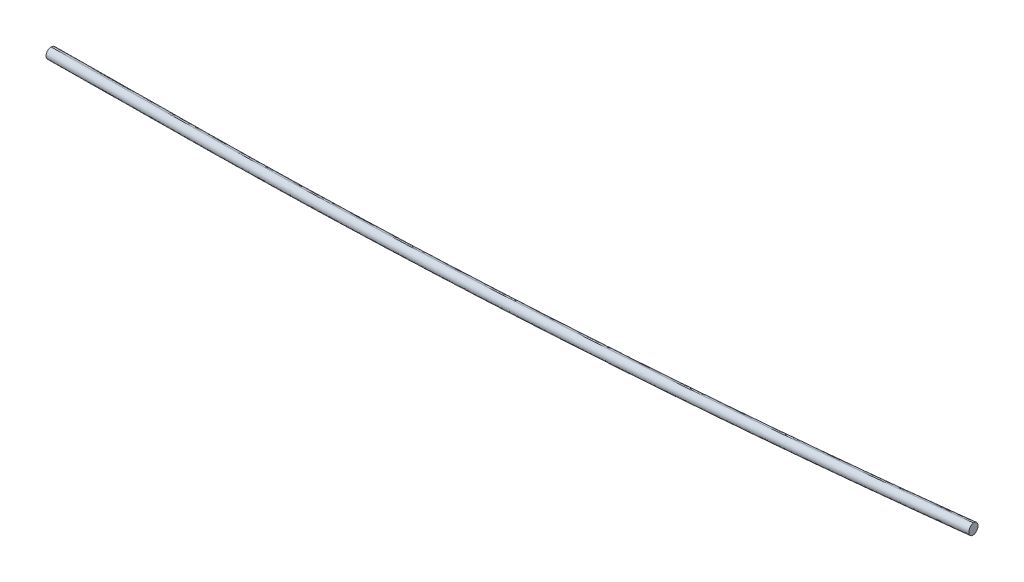
ISO-10303-21;
HEADER;
FILE_DESCRIPTION(('STEP AP214'),'2;1');
FILE_NAME('part.step','',(''),(''),'','','');
FILE_SCHEMA(('AUTOMOTIVE_DESIGN { 1 0 10303 214 1 1 1 1 }'));
ENDSEC;
DATA;
#1=APPLICATION_CONTEXT('core data for automotive mechanical design processes');
#2=APPLICATION_PROTOCOL_DEFINITION('international standard','automotive_design',2000,#1);
#3=PRODUCT_CONTEXT('',#1,'mechanical');
#4=PRODUCT('Part','Part','',(#3));
#5=PRODUCT_RELATED_PRODUCT_CATEGORY('part','',(#4));
#6=PRODUCT_DEFINITION_FORMATION('','',#4);
#7=PRODUCT_DEFINITION_CONTEXT('part definition',#1,'design');
#8=PRODUCT_DEFINITION('design','',#6,#7);
#9=PRODUCT_DEFINITION_SHAPE('','',#8);
#10=(LENGTH_UNIT() NAMED_UNIT(*) SI_UNIT(.MILLI.,.METRE.));
#11=(NAMED_UNIT(*) PLANE_ANGLE_UNIT() SI_UNIT($,.RADIAN.));
#12=(NAMED_UNIT(*) SI_UNIT($,.STERADIAN.) SOLID_ANGLE_UNIT());
#13=UNCERTAINTY_MEASURE_WITH_UNIT(LENGTH_MEASURE(1.E-05),#10,'distance_accuracy_value','');
#14=(GEOMETRIC_REPRESENTATION_CONTEXT(3) GLOBAL_UNCERTAINTY_ASSIGNED_CONTEXT((#13)) GLOBAL_UNIT_ASSIGNED_CONTEXT((#10,
#11,#12)) REPRESENTATION_CONTEXT('',''));
#15=CARTESIAN_POINT('',(0.,0.,0.));
#16=DIRECTION('',(0.,0.,1.));
#17=DIRECTION('',(1.,0.,0.));
#18=AXIS2_PLACEMENT_3D('',#15,#16,#17);
#19=CARTESIAN_POINT('',(48.2480433152623,-0.345679682290023,-13.036057605135));
#20=CARTESIAN_POINT('',(38.1962285899839,-0.437378649195115,-11.90775380431));
#21=CARTESIAN_POINT('',(25.9777641534719,-0.548843155517252,-11.1113298148152));
#22=CARTESIAN_POINT('',(13.3718044772752,-0.663842636779822,-11.0084394877684));
#23=CARTESIAN_POINT('',(10.1395513241844,-0.69332928003925,-11.014852044903));
#24=CARTESIAN_POINT('',(7.86282266951127,-0.714099028712762,-11.0125531852611));
#25=CARTESIAN_POINT('',(5.95615670387059,-0.7314928331213,-11.0142054689053));
#26=CARTESIAN_POINT('',(4.78825930001637,-0.742147126730119,-11.0133602864107));
#27=CARTESIAN_POINT('',(48.2490336071157,-0.328867365471454,-13.02586452825));
#28=CARTESIAN_POINT('',(38.1969245008365,-0.420569017904918,-11.897528610167));
#29=CARTESIAN_POINT('',(25.978026001136,-0.532037484024071,-11.1010734068498));
#30=CARTESIAN_POINT('',(13.3716936881949,-0.647040364712956,-10.998183093019));
#31=CARTESIAN_POINT('',(10.1393932989886,-0.676527438889997,-11.0045947753367));
#32=CARTESIAN_POINT('',(7.86267456311472,-0.697297097077893,-11.0022964543361));
#33=CARTESIAN_POINT('',(5.95600011428303,-0.714690978875526,-11.003948314129));
#34=CARTESIAN_POINT('',(4.78810729009024,-0.725345230705798,-11.0031033565329));
#35=CARTESIAN_POINT('',(48.2523907534692,-0.285489373296981,-12.992416543255));
#36=CARTESIAN_POINT('',(38.1993156531754,-0.377199838134534,-11.863975234271));
#37=CARTESIAN_POINT('',(25.9789928005527,-0.4886812980956,-11.067417604622));
#38=CARTESIAN_POINT('',(13.371437701942,-0.603695333803426,-10.9645273341587));
#39=CARTESIAN_POINT('',(10.1389823101964,-0.633183822010878,-10.9709361458164));
#40=CARTESIAN_POINT('',(7.86229612228021,-0.653953183275962,-10.9686395923355));
#41=CARTESIAN_POINT('',(5.95559383635184,-0.671347319020975,-10.9702900612854));
#42=CARTESIAN_POINT('',(4.78771604004973,-0.682001433757389,-10.9694458416803));
#43=CARTESIAN_POINT('',(48.2605466762364,-0.236173789437014,-12.915715991235));
#44=CARTESIAN_POINT('',(38.2052564268256,-0.327904462256023,-11.7870330072934));
#45=CARTESIAN_POINT('',(25.9816673488715,-0.439415718775895,-10.9902405008317));
#46=CARTESIAN_POINT('',(13.3713082447064,-0.554455334383427,-10.8873503298156));
#47=CARTESIAN_POINT('',(10.1384974121058,-0.583947065145591,-10.8937525586789));
#48=CARTESIAN_POINT('',(7.86188586086493,-0.604715745528048,-10.8914600583491));
#49=CARTESIAN_POINT('',(5.95511974087571,-0.622110463607454,-10.893107337916));
#50=CARTESIAN_POINT('',(4.78727640547068,-0.632764263969922,-10.8922648106197));
#51=CARTESIAN_POINT('',(48.2707128284359,-0.220033257834718,-12.823796329898));
#52=CARTESIAN_POINT('',(38.2127678946473,-0.311788148351879,-11.6948237172693));
#53=CARTESIAN_POINT('',(25.9852644990292,-0.423335113735846,-10.8977497291683));
#54=CARTESIAN_POINT('',(13.3715450117206,-0.53840538486888,-10.794859677332));
#55=CARTESIAN_POINT('',(10.1383082108367,-0.567901001581252,-10.8012540172269));
#56=CARTESIAN_POINT('',(7.86178610586194,-0.588668865978693,-10.7989663742842));
#57=CARTESIAN_POINT('',(5.95494348570192,-0.606064281940703,-10.800609831623));
#58=CARTESIAN_POINT('',(4.78714144900744,-0.616717705550396,-10.7997693324277));
#59=CARTESIAN_POINT('',(48.2811717522907,-0.235985634539793,-12.731876668561));
#60=CARTESIAN_POINT('',(38.2205721341244,-0.327764742755107,-11.6026144272452));
#61=CARTESIAN_POINT('',(25.9891544208522,-0.439347417003077,-10.8052589575049));
#62=CARTESIAN_POINT('',(13.3720745504102,-0.554448343661523,-10.7023690248484));
#63=CARTESIAN_POINT('',(10.1384117812329,-0.583947846324193,-10.7087554757748));
#64=CARTESIAN_POINT('',(7.86197912252329,-0.604714894736628,-10.7064726902193));
#65=CARTESIAN_POINT('',(5.95506000219446,-0.622111008581223,-10.7081123253301));
#66=CARTESIAN_POINT('',(4.78729926421052,-0.632764055438141,-10.7072738542356));
#67=CARTESIAN_POINT('',(48.2916982080869,-0.293137218096374,-12.642704893152));
#68=CARTESIAN_POINT('',(38.2285232658205,-0.384939820035545,-11.5131616814338));
#69=CARTESIAN_POINT('',(25.9933082511752,-0.496557135651513,-10.7155331447876));
#70=CARTESIAN_POINT('',(13.3729684543397,-0.611687801405897,-10.612643327748));
#71=CARTESIAN_POINT('',(10.1388924509553,-0.641191073850534,-10.6190221255422));
#72=CARTESIAN_POINT('',(7.86254656456604,-0.661957330671365,-10.6167440521649));
#73=CARTESIAN_POINT('',(5.95555323099625,-0.679354121535754,-10.6183799793111));
#74=CARTESIAN_POINT('',(4.78783255712124,-0.690006802902709,-10.6175434756886));
#75=CARTESIAN_POINT('',(48.2988677017085,-0.382000701961753,-12.586030928852));
#76=CARTESIAN_POINT('',(38.2340559878887,-0.473818235558998,-11.4563091437403));
#77=CARTESIAN_POINT('',(25.9964275624862,-0.585457567823621,-10.6585070568423));
#78=CARTESIAN_POINT('',(13.3740158886321,-0.700607134541399,-10.5556173132841));
#79=CARTESIAN_POINT('',(10.139677250342,-0.730112802906591,-10.5619912470579));
#80=CARTESIAN_POINT('',(7.863386512921,-0.750878556623899,-10.5597161685501));
#81=CARTESIAN_POINT('',(5.95634601242483,-0.768275777774612,-10.5613497390642));
#82=CARTESIAN_POINT('',(4.78865080167329,-0.778928226850963,-10.5605144858871));
#83=CARTESIAN_POINT('',(48.3015128404969,-0.475111946549727,-12.570026314331));
#84=CARTESIAN_POINT('',(38.2362389056503,-0.566933696817474,-11.4402541004491));
#85=CARTESIAN_POINT('',(25.9979289378569,-0.678579246539826,-10.6424030033059));
#86=CARTESIAN_POINT('',(13.3749321700688,-0.793734150851934,-10.5395132804988));
#87=CARTESIAN_POINT('',(10.1405193642048,-0.823240495820316,-10.5458858406829));
#88=CARTESIAN_POINT('',(7.86424420074179,-0.844006107462198,-10.5436116079202));
#89=CARTESIAN_POINT('',(5.95719038039987,-0.86140345012491,-10.5452445129261));
#90=CARTESIAN_POINT('',(4.78950236038411,-0.872055833602852,-10.5444096128723));
#91=CARTESIAN_POINT('',(48.3005715606973,-0.568255908700491,-12.585988843174));
#92=CARTESIAN_POINT('',(38.2357586314281,-0.660073453385829,-11.4562669254544));
#93=CARTESIAN_POINT('',(25.9981284138401,-0.771712801999894,-10.6584647096792));
#94=CARTESIAN_POINT('',(13.3757152014201,-0.886862382753436,-10.5555749661756));
#95=CARTESIAN_POINT('',(10.1413763681041,-0.916368052897777,-10.5619488963374));
#96=CARTESIAN_POINT('',(7.86508567163637,-0.937133806241483,-10.5596738200535));
#97=CARTESIAN_POINT('',(5.95804513611466,-0.954531027711721,-10.5613073888176));
#98=CARTESIAN_POINT('',(4.79034994427133,-0.965183476615579,-10.5604721365691));
#99=CARTESIAN_POINT('',(48.2950008542725,-0.657235616672097,-12.642873235866));
#100=CARTESIAN_POINT('',(38.2318307738339,-0.749038174258622,-11.5133305545775));
#101=CARTESIAN_POINT('',(25.9966229279103,-0.860655424477008,-10.71570253344));
#102=CARTESIAN_POINT('',(13.3762892853188,-0.975786034088514,-10.6128127161821));
#103=CARTESIAN_POINT('',(10.1422140620578,-1.00528929941637,-10.6191915284243));
#104=CARTESIAN_POINT('',(7.86586801185541,-1.02605555773161,-10.6169134461512));
#105=CARTESIAN_POINT('',(5.95887481838879,-1.04345234731789,-10.6185493802974));
#106=CARTESIAN_POINT('',(4.79115406887992,-1.05410502937483,-10.6177128729606));
#107=CARTESIAN_POINT('',(48.2856085197856,-0.714568911943515,-12.731245383381));
#108=CARTESIAN_POINT('',(38.224990669798,-0.806348186480954,-11.6019811529561));
#109=CARTESIAN_POINT('',(25.9935460738044,-0.917931105969993,-10.8046237500583));
#110=CARTESIAN_POINT('',(13.3764431249426,-1.03303224316428,-10.7017338182202));
#111=CARTESIAN_POINT('',(10.1427774303071,-1.06253177251481,-10.7081202149669));
#112=CARTESIAN_POINT('',(7.86634538589593,-1.08329881532323,-10.7058374627708));
#113=CARTESIAN_POINT('',(5.95942574017996,-1.10069493396074,-10.7074770716314));
#114=CARTESIAN_POINT('',(4.79166528582622,-1.11134797823021,-10.7066386144655));
#115=CARTESIAN_POINT('',(48.2753715432232,-0.730710089650132,-12.823796329898));
#116=CARTESIAN_POINT('',(38.2174266094346,-0.822464980167293,-11.6948237172693));
#117=CARTESIAN_POINT('',(25.9899232138165,-0.93401194555126,-10.8977497291683));
#118=CARTESIAN_POINT('',(13.3762037265079,-1.04908221668429,-10.794859677332));
#119=CARTESIAN_POINT('',(10.142966925624,-1.07857783339667,-10.8012540172269));
#120=CARTESIAN_POINT('',(7.86644482064924,-1.09934569779411,-10.7989663742842));
#121=CARTESIAN_POINT('',(5.95960220048922,-1.11674111375612,-10.800609831623));
#122=CARTESIAN_POINT('',(4.79180016379473,-1.12739453736581,-10.7997693324277));
#123=CARTESIAN_POINT('',(48.2648417949854,-0.714758359049558,-12.916347276414));
#124=CARTESIAN_POINT('',(38.209569777396,-0.806488865546442,-11.7876662815825));
#125=CARTESIAN_POINT('',(25.9860075821733,-0.917999876825155,-10.9908757082784));
#126=CARTESIAN_POINT('',(13.3756715564078,-1.03303928189703,-10.8879855364438));
#127=CARTESIAN_POINT('',(10.1428636492755,-1.06253098597124,-10.8943878194869));
#128=CARTESIAN_POINT('',(7.86625148373622,-1.08329967195771,-10.8920952857975));
#129=CARTESIAN_POINT('',(5.95948588913414,-1.1006943852442,-10.8937425916147));
#130=CARTESIAN_POINT('',(4.79164227009791,-1.11134818819413,-10.8929000503899));
#131=CARTESIAN_POINT('',(48.255864693293,-0.665599073399004,-12.992360033439));
#132=CARTESIAN_POINT('',(38.2027879609671,-0.757309553124979,-11.863918546398));
#133=CARTESIAN_POINT('',(25.9824627019245,-0.868791035038918,-11.0673607437021));
#134=CARTESIAN_POINT('',(13.3749055374297,-0.983805089593036,-10.964470473312));
#135=CARTESIAN_POINT('',(10.142449883812,-1.01329358018945,-10.9708792801198));
#136=CARTESIAN_POINT('',(7.86576375088556,-1.03406294095288,-10.9685827296251));
#137=CARTESIAN_POINT('',(5.95906141792614,-1.05145707712694,-10.9702331962251));
#138=CARTESIAN_POINT('',(4.79118364701398,-1.06211119163173,-10.9693889778669));
#139=CARTESIAN_POINT('',(48.2517168155629,-0.622289546767707,-13.025807246383));
#140=CARTESIAN_POINT('',(38.1996060549526,-0.713991214293019,-11.897471147811));
#141=CARTESIAN_POINT('',(25.9807051159636,-0.825459702664994,-11.1010157690819));
#142=CARTESIAN_POINT('',(13.3743707089196,-0.940462602457601,-10.9981254553254));
#143=CARTESIAN_POINT('',(10.1420700542623,-0.969949679056151,-11.0045371327269));
#144=CARTESIAN_POINT('',(7.86535137412814,-0.990719336735655,-11.0022388147534));
#145=CARTESIAN_POINT('',(5.95867687762343,-1.00811321896809,-11.0038906721643));
#146=CARTESIAN_POINT('',(4.79078407916758,-1.01876747056358,-11.003045715832));
#147=CARTESIAN_POINT('',(48.2504182544761,-0.605498110303157,-13.036015605699));
#148=CARTESIAN_POINT('',(38.1986023162382,-0.697197088273627,-11.907711672538));
#149=CARTESIAN_POINT('',(25.9801360912206,-0.808661610911636,-11.1112875544299));
#150=CARTESIAN_POINT('',(13.3741748796178,-0.923661106181144,-11.0083972274376));
#151=CARTESIAN_POINT('',(10.1419215318911,-0.953147751216164,-11.0148097809675));
#152=CARTESIAN_POINT('',(7.86519291808724,-0.973917499516841,-11.0125109235451));
#153=CARTESIAN_POINT('',(5.95852691749302,-0.991311304244246,-11.0141632054429));
#154=CARTESIAN_POINT('',(4.79062953250901,-1.00196559768092,-11.013318023875));
#155=B_SPLINE_SURFACE_WITH_KNOTS('',3,3,((#19,#20,#21,#22,#23,#24,#25,#26),(#27,#28,#29,#30,#31,
#32,#33,#34),(#35,#36,#37,#38,#39,#40,#41,#42),(#43,#44,#45,#46,#47,#48,#49,#50),(#51,#52,#53,
#54,#55,#56,#57,#58),(#59,#60,#61,#62,#63,#64,#65,#66),(#67,#68,#69,#70,#71,#72,#73,#74),(#75,
#76,#77,#78,#79,#80,#81,#82),(#83,#84,#85,#86,#87,#88,#89,#90),(#91,#92,#93,#94,#95,#96,#97,
#98),(#99,#100,#101,#102,#103,#104,#105,#106),(#107,#108,#109,#110,#111,#112,#113,#114),(#115,
#116,#117,#118,#119,#120,#121,#122),(#123,#124,#125,#126,#127,#128,#129,#130),(#131,#132,#133,
#134,#135,#136,#137,#138),(#139,#140,#141,#142,#143,#144,#145,#146),(#147,#148,#149,#150,#151,
#152,#153,#154)),.UNSPECIFIED.,.F.,.F.,.F.,(4,1,1,1,1,1,1,1,1,1,1,1,1,1,4),(4,1,1,1,1,4),(0.,
0.0441028432843011,0.120085702736918,0.196068562189534,0.272051421642151,0.348034281094767,
0.424017140547384,0.5,0.575982859452617,0.651965718905233,0.727948578357849,0.803931437810466,
0.879914297263082,0.955897156715699,1.),(0.,0.696904690616881,0.843220665211104,
0.868666006583359,0.919558575428231,1.),.UNSPECIFIED.);
#156=CARTESIAN_POINT('',(47.8463713313732,-0.229253630668435,-12.776442060781));
#157=CARTESIAN_POINT('',(37.9285608639567,-0.319730126572751,-11.6763882824589));
#158=CARTESIAN_POINT('',(25.842992054967,-0.429982275516339,-10.8965888154734));
#159=CARTESIAN_POINT('',(13.3715938069982,-0.543754202920127,-10.794859677332));
#160=CARTESIAN_POINT('',(10.1383570061142,-0.573249819632498,-10.8012540172269));
#161=CARTESIAN_POINT('',(8.00410862125154,-0.592719773800933,-10.7991093430131));
#162=CARTESIAN_POINT('',(6.23951111563684,-0.608817540491881,-10.8003844265833));
#163=CARTESIAN_POINT('',(5.2139251185505,-0.618173580070351,-10.8));
#164=B_SPLINE_CURVE_WITH_KNOTS('',3,(#156,#157,#158,#159,#160,#161,#162,#163),.UNSPECIFIED.,.F.,
.F.,(4,1,1,1,1,4),(0.,0.7008394486827,0.8500804419024,0.8760344638726,0.9279444316186,1.),.UNSPECIFIED.);
#165=CARTESIAN_POINT('',(47.8463713313732,-0.229253630668435,-12.776442060781));
#166=VERTEX_POINT('',#165);
#167=CARTESIAN_POINT('',(5.2139251185505,-0.618173580070351,-10.8));
#168=VERTEX_POINT('',#167);
#169=EDGE_CURVE('E64',#166,#168,#164,.T.);
#170=CARTESIAN_POINT('',(5.21848624278269,-1.11815277578327,-10.8));
#171=CARTESIAN_POINT('',(5.21848624278269,-1.11815277578327,-10.7689562394405));
#172=CARTESIAN_POINT('',(5.21838865220458,-1.10745513968109,-10.7068687183216));
#173=CARTESIAN_POINT('',(5.2178664469975,-1.05021229106752,-10.6179424385531));
#174=CARTESIAN_POINT('',(5.21705524933223,-0.961290802833142,-10.5607013556859));
#175=CARTESIAN_POINT('',(5.2162056806506,-0.868163177926957,-10.5446387347634));
#176=CARTESIAN_POINT('',(5.21535611196696,-0.775035553020789,-10.5607437052603));
#177=CARTESIAN_POINT('',(5.21454491430769,-0.686114064786353,-10.6177730402557));
#178=CARTESIAN_POINT('',(5.21402270908262,-0.628871216172954,-10.7075039619368));
#179=CARTESIAN_POINT('',(5.2139251185505,-0.618173580070351,-10.7691679873123));
#180=CARTESIAN_POINT('',(5.2139251185505,-0.618173580070351,-10.8));
#181=B_SPLINE_CURVE_WITH_KNOTS('',3,(#170,#171,#172,#173,#174,#175,#176,#177,#178,#179,#180),
.UNSPECIFIED.,.F.,.F.,(4,1,1,1,1,1,1,1,4),(0.,0.125,0.25,0.375,0.5,0.625,0.75,0.875,1.),.UNSPECIFIED.);
#182=CARTESIAN_POINT('',(5.21848624278269,-1.11815277578327,-10.8));
#183=VERTEX_POINT('',#182);
#184=EDGE_CURVE('E22',#183,#168,#181,.T.);
#185=CARTESIAN_POINT('',(47.8509324556054,-0.729232826381355,-12.776442060781));
#186=CARTESIAN_POINT('',(37.9331219881888,-0.819709322285671,-11.6763882824589));
#187=CARTESIAN_POINT('',(25.8475531791992,-0.929961471229259,-10.8965888154734));
#188=CARTESIAN_POINT('',(13.3761549312304,-1.04373339863305,-10.794859677332));
#189=CARTESIAN_POINT('',(10.1429181303464,-1.07322901534542,-10.8012540172269));
#190=CARTESIAN_POINT('',(8.00866974548373,-1.09269896951385,-10.7991093430131));
#191=CARTESIAN_POINT('',(6.24407223986903,-1.1087967362048,-10.8003844265833));
#192=CARTESIAN_POINT('',(5.21848624278269,-1.11815277578327,-10.8));
#193=B_SPLINE_CURVE_WITH_KNOTS('',3,(#185,#186,#187,#188,#189,#190,#191,#192),.UNSPECIFIED.,.F.,
.F.,(4,1,1,1,1,4),(0.,0.7008394486827,0.8500804419024,0.8760344638726,0.9279444316186,1.),.UNSPECIFIED.);
#194=CARTESIAN_POINT('',(47.8509324556054,-0.729232826381355,-12.776442060781));
#195=VERTEX_POINT('',#194);
#196=EDGE_CURVE('E57',#195,#183,#193,.T.);
#197=CARTESIAN_POINT('',(47.8463713313732,-0.229253630668435,-12.776442060781));
#198=CARTESIAN_POINT('',(47.8497713949655,-0.229222613152956,-12.745798111756));
#199=CARTESIAN_POINT('',(47.8566691126452,-0.23985821422494,-12.6845102137));
#200=CARTESIAN_POINT('',(47.8670865797564,-0.297010792044755,-12.595326616839));
#201=CARTESIAN_POINT('',(47.8741868045804,-0.38587490782361,-12.538645139302));
#202=CARTESIAN_POINT('',(47.8768123820027,-0.478986330862651,-12.522638403058));
#203=CARTESIAN_POINT('',(47.8758906121313,-0.572130115031597,-12.538603048044));
#204=CARTESIAN_POINT('',(47.8703894317036,-0.661109188743393,-12.595494981871));
#205=CARTESIAN_POINT('',(47.8611051085623,-0.71844149866748,-12.683878844831));
#206=CARTESIAN_POINT('',(47.854355870126,-0.729201595844042,-12.745587655466));
#207=CARTESIAN_POINT('',(47.8509324556054,-0.729232826381355,-12.776442060781));
#208=B_SPLINE_CURVE_WITH_KNOTS('',3,(#197,#198,#199,#200,#201,#202,#203,#204,#205,#206,#207),
.UNSPECIFIED.,.F.,.F.,(4,1,1,1,1,1,1,1,4),(0.,0.125,0.25,0.375,0.5,0.625,0.75,0.875,1.),.UNSPECIFIED.);
#209=EDGE_CURVE('E10',#166,#195,#208,.T.);
#210=ORIENTED_EDGE('',*,*,#169,.T.);
#211=ORIENTED_EDGE('',*,*,#184,.F.);
#212=ORIENTED_EDGE('',*,*,#196,.F.);
#213=ORIENTED_EDGE('',*,*,#209,.F.);
#214=EDGE_LOOP('',(#210,#211,#212,#213));
#215=FACE_BOUND('',#214,.T.);
#216=ADVANCED_FACE('F16',(#215),#155,.F.);
#217=CARTESIAN_POINT('',(47.8486518934593,-0.479243228525168,-12.776442060778));
#218=DIRECTION('',(-0.993859021947617,-0.00906660618532011,0.110281644645005));
#219=DIRECTION('',(-0.00912224846437236,0.99995839142584,0.));
#220=AXIS2_PLACEMENT_3D('',#217,#218,#219);
#221=PLANE('',#220);
#222=CARTESIAN_POINT('',(47.8509324556054,-0.729232826381355,-12.776442060781));
#223=CARTESIAN_POINT('',(47.8475090410847,-0.729264056918667,-12.807296466096));
#224=CARTESIAN_POINT('',(47.8405646214382,-0.718628881891354,-12.869005276721));
#225=CARTESIAN_POINT('',(47.8302358879148,-0.661475494588023,-12.957389139686));
#226=CARTESIAN_POINT('',(47.8231123121425,-0.572611591831185,-13.014281073511));
#227=CARTESIAN_POINT('',(47.8204914049158,-0.479500126187685,-13.030245718498));
#228=CARTESIAN_POINT('',(47.8214178449629,-0.386356299414465,-13.014238982253));
#229=CARTESIAN_POINT('',(47.8268956744723,-0.297377438724411,-12.957557504718));
#230=CARTESIAN_POINT('',(47.8362687311113,-0.240044319317628,-12.868373907853));
#231=CARTESIAN_POINT('',(47.8429712677809,-0.229284648183913,-12.807086009807));
#232=CARTESIAN_POINT('',(47.8463713313732,-0.229253630668435,-12.776442060781));
#233=B_SPLINE_CURVE_WITH_KNOTS('',3,(#222,#223,#224,#225,#226,#227,#228,#229,#230,#231,#232),
.UNSPECIFIED.,.F.,.F.,(4,1,1,1,1,1,1,1,4),(0.,0.125,0.25,0.375,0.5,0.625,0.75,0.875,1.),.UNSPECIFIED.);
#234=EDGE_CURVE('E30',#195,#166,#233,.T.);
#235=ORIENTED_EDGE('',*,*,#234,.T.);
#236=ORIENTED_EDGE('',*,*,#209,.T.);
#237=EDGE_LOOP('',(#235,#236));
#238=FACE_BOUND('',#237,.T.);
#239=ADVANCED_FACE('F95',(#238),#221,.F.);
#240=CARTESIAN_POINT('',(48.2980363429429,-0.605063708193912,-12.611577053928));
#241=CARTESIAN_POINT('',(38.2339624140937,-0.696874511253295,-11.4819357619347));
#242=CARTESIAN_POINT('',(25.997421848395,-0.808503919378477,-10.6842119039026));
#243=CARTESIAN_POINT('',(13.3759440858906,-0.923644966370385,-10.5813221272264));
#244=CARTESIAN_POINT('',(10.1417238318384,-0.953149554760208,-10.5876982534862));
#245=CARTESIAN_POINT('',(7.86540823952465,-0.973915535219457,-10.585421825027));
#246=CARTESIAN_POINT('',(5.95838900363166,-0.991312562381106,-10.5870564577966));
#247=CARTESIAN_POINT('',(4.79068231905554,-1.00196511612889,-10.5862206409886));
#248=CARTESIAN_POINT('',(48.2970443365409,-0.621876040653672,-12.621785413244));
#249=CARTESIAN_POINT('',(38.233265230064,-0.713684154158212,-11.4921762866616));
#250=CARTESIAN_POINT('',(25.9971593783367,-0.825309596549527,-10.6944836892506));
#251=CARTESIAN_POINT('',(13.3760548112636,-0.940447239018329,-10.5915938993386));
#252=CARTESIAN_POINT('',(10.141881864153,-0.969951395844521,-10.5979709017268));
#253=CARTESIAN_POINT('',(7.86555633816752,-0.990717466924961,-10.5956939338188));
#254=CARTESIAN_POINT('',(5.95854559818601,-1.00811441658157,-10.5973289910751));
#255=CARTESIAN_POINT('',(4.79083432708174,-1.01876701217054,-10.5964929490315));
#256=CARTESIAN_POINT('',(48.2936872768037,-0.665254032037976,-12.655232626188));
#257=CARTESIAN_POINT('',(38.2308741420425,-0.757053333341853,-11.5257288880747));
#258=CARTESIAN_POINT('',(25.9961926103588,-0.868665782191195,-10.7281387146305));
#259=CARTESIAN_POINT('',(13.3763108007363,-0.983792269898586,-10.6252488813519));
#260=CARTESIAN_POINT('',(10.1422928525861,-1.01329501272691,-10.6316287543339));
#261=CARTESIAN_POINT('',(7.86593477939401,-1.03406138072342,-10.6293500189471));
#262=CARTESIAN_POINT('',(5.95895187586622,-1.05145807643841,-10.6309864670143));
#263=CARTESIAN_POINT('',(4.79122557721725,-1.06211080911809,-10.6301496869967));
#264=CARTESIAN_POINT('',(48.2856085182857,-0.714568911957199,-12.731245383213));
#265=CARTESIAN_POINT('',(38.224990668798,-0.806348186490076,-11.6019811528905));
#266=CARTESIAN_POINT('',(25.9935460732944,-0.917931105974645,-10.8046237500542));
#267=CARTESIAN_POINT('',(13.3764431249426,-1.03303224316428,-10.7017338182202));
#268=CARTESIAN_POINT('',(10.1427774303071,-1.06253177251481,-10.7081202149669));
#269=CARTESIAN_POINT('',(7.86634538972777,-1.08329881528828,-10.7058374627747));
#270=CARTESIAN_POINT('',(5.95942574784264,-1.10069493389084,-10.7074770716248));
#271=CARTESIAN_POINT('',(4.79166529731874,-1.11134797812536,-10.7066386144737));
#272=CARTESIAN_POINT('',(48.2753715417233,-0.730710089663815,-12.823796329729));
#273=CARTESIAN_POINT('',(38.2174266084247,-0.822464980176506,-11.6948237172038));
#274=CARTESIAN_POINT('',(25.9899232133165,-0.934011945555821,-10.8977497291642));
#275=CARTESIAN_POINT('',(13.3762037265079,-1.04908221668429,-10.794859677332));
#276=CARTESIAN_POINT('',(10.142966925624,-1.07857783339667,-10.8012540172269));
#277=CARTESIAN_POINT('',(7.86644482448008,-1.09934569775916,-10.798966374288));
#278=CARTESIAN_POINT('',(5.9596022081519,-1.11674111368621,-10.8006098316164));
#279=CARTESIAN_POINT('',(4.79180017528726,-1.12739453726097,-10.7997693324359));
#280=CARTESIAN_POINT('',(48.2648417934855,-0.714758359063242,-12.916347276246));
#281=CARTESIAN_POINT('',(38.209569776386,-0.806488865555656,-11.787666281517));
#282=CARTESIAN_POINT('',(25.9860075816633,-0.917999876829807,-10.9908757082743));
#283=CARTESIAN_POINT('',(13.3756715564078,-1.03303928189703,-10.8879855364438));
#284=CARTESIAN_POINT('',(10.1428636492755,-1.06253098597124,-10.8943878194869));
#285=CARTESIAN_POINT('',(7.86625148756806,-1.08329967192275,-10.8920952858014));
#286=CARTESIAN_POINT('',(5.95948589679582,-1.10069438517431,-10.893742591608));
#287=CARTESIAN_POINT('',(4.79164228159043,-1.11134818808929,-10.8929000503982));
#288=CARTESIAN_POINT('',(48.2544050485764,-0.657605957107606,-13.004719423761));
#289=CARTESIAN_POINT('',(38.2016852619279,-0.749313180550934,-11.876316879896));
#290=CARTESIAN_POINT('',(25.9818863171252,-0.860789861095829,-11.0797969248925));
#291=CARTESIAN_POINT('',(13.3747809855996,-0.975799793745831,-10.9769066384818));
#292=CARTESIAN_POINT('',(10.1423826070926,-1.00528776184271,-10.9833165060294));
#293=CARTESIAN_POINT('',(7.86568445117643,-1.02605723228741,-10.981019302421));
#294=CARTESIAN_POINT('',(5.95899240815484,-1.04345127459019,-10.982670282942));
#295=CARTESIAN_POINT('',(4.79110908810558,-1.0541054397177,-10.9818257919031));
#296=CARTESIAN_POINT('',(48.2472119468171,-0.568742688610487,-13.061603816454));
#297=CARTESIAN_POINT('',(38.1961350090092,-0.66043492495491,-11.933380509019));
#298=CARTESIAN_POINT('',(25.9787584358708,-0.771889507104127,-11.1370347486534));
#299=CARTESIAN_POINT('',(13.3737326741737,-0.886880468612092,-11.0341443884884));
#300=CARTESIAN_POINT('',(10.1415979057208,-0.916366031892502,-11.0405591381164));
#301=CARTESIAN_POINT('',(7.86484439607192,-0.937136007308713,-11.0382589285187));
#302=CARTESIAN_POINT('',(5.95819969510442,-0.954529617727547,-11.0399122744218));
#303=CARTESIAN_POINT('',(4.79029081738962,-0.965184016008129,-11.0390665282946));
#304=CARTESIAN_POINT('',(48.2445715296622,-0.475631400948805,-13.077566345296));
#305=CARTESIAN_POINT('',(38.1939555974117,-0.567319431711002,-11.949393334024));
#306=CARTESIAN_POINT('',(25.9772587744788,-0.678767812751932,-11.1530964550266));
#307=CARTESIAN_POINT('',(13.3728165681597,-0.79375345070124,-11.0502060741652));
#308=CARTESIAN_POINT('',(10.1407557722558,-0.823238339157601,-11.0566221937709));
#309=CARTESIAN_POINT('',(7.86398672960124,-0.844008456275645,-11.054321140652));
#310=CARTESIAN_POINT('',(5.95735531345395,-0.861401945502005,-11.0559751503133));
#311=CARTESIAN_POINT('',(4.78943926391258,-0.872056409208493,-11.0551290519914));
#312=CARTESIAN_POINT('',(48.2455175310754,-0.382487395724518,-13.061561730775));
#313=CARTESIAN_POINT('',(38.194439377808,-0.474179643157125,-11.933338290733));
#314=CARTESIAN_POINT('',(25.9770610124942,-0.585634241655692,-11.1369924014903));
#315=CARTESIAN_POINT('',(13.3720337122311,-0.700625217199423,-11.0341020413798));
#316=CARTESIAN_POINT('',(10.1398987487524,-0.730110782258981,-11.0405167873958));
#317=CARTESIAN_POINT('',(7.86314528005677,-0.750880757301591,-11.0382165800221));
#318=CARTESIAN_POINT('',(5.95650054406372,-0.76827436803995,-11.0398699241752));
#319=CARTESIAN_POINT('',(4.78859168525714,-0.778928766148039,-11.0390241789766));
#320=CARTESIAN_POINT('',(48.2510646293825,-0.293507903120988,-13.004887766475));
#321=CARTESIAN_POINT('',(38.1983497045517,-0.385215082211761,-11.876485753039));
#322=CARTESIAN_POINT('',(25.9785579284807,-0.496691697358983,-11.079966313545));
#323=CARTESIAN_POINT('',(13.371458751199,-0.611701573866107,-10.977076026916));
#324=CARTESIAN_POINT('',(10.1390611528155,-0.641189534846212,-10.9834859089115));
#325=CARTESIAN_POINT('',(7.86236283308617,-0.661959006785316,-10.9811886964073));
#326=CARTESIAN_POINT('',(5.95567093016775,-0.679353047809991,-10.9828396839283));
#327=CARTESIAN_POINT('',(4.78778753448364,-0.690007213627485,-10.9819951891751));
#328=CARTESIAN_POINT('',(48.2605466747365,-0.236173789450698,-12.915715991066));
#329=CARTESIAN_POINT('',(38.2052564258157,-0.327904462265236,-11.7870330072279));
#330=CARTESIAN_POINT('',(25.9816673483716,-0.439415718780456,-10.9902405008276));
#331=CARTESIAN_POINT('',(13.3713082447064,-0.554455334383427,-10.8873503298156));
#332=CARTESIAN_POINT('',(10.1384974121058,-0.583947065145591,-10.8937525586789));
#333=CARTESIAN_POINT('',(7.86188586469677,-0.604715745493091,-10.891460058353));
#334=CARTESIAN_POINT('',(5.9551197485374,-0.622110463537559,-10.8931073379094));
#335=CARTESIAN_POINT('',(4.7872764169632,-0.63276426386508,-10.892264810628));
#336=CARTESIAN_POINT('',(48.270712826936,-0.220033257848401,-12.823796329729));
#337=CARTESIAN_POINT('',(38.2127678936374,-0.311788148361092,-11.6948237172038));
#338=CARTESIAN_POINT('',(25.9852644985292,-0.423335113740407,-10.8977497291642));
#339=CARTESIAN_POINT('',(13.3715450117206,-0.53840538486888,-10.794859677332));
#340=CARTESIAN_POINT('',(10.1383082108367,-0.567901001581252,-10.8012540172269));
#341=CARTESIAN_POINT('',(7.86178610969279,-0.588668865943746,-10.798966374288));
#342=CARTESIAN_POINT('',(5.9549434933646,-0.606064281870799,-10.8006098316164));
#343=CARTESIAN_POINT('',(4.78714146049996,-0.616717705445554,-10.7997693324359));
#344=CARTESIAN_POINT('',(48.2811717507908,-0.235985634553477,-12.731876668392));
#345=CARTESIAN_POINT('',(38.2205721331244,-0.327764742764229,-11.6026144271796));
#346=CARTESIAN_POINT('',(25.9891544203422,-0.43934741700773,-10.8052589575008));
#347=CARTESIAN_POINT('',(13.3720745504102,-0.554448343661523,-10.7023690248484));
#348=CARTESIAN_POINT('',(10.1384117812329,-0.583947846324193,-10.7087554757748));
#349=CARTESIAN_POINT('',(7.86197912635413,-0.60471489470168,-10.7064726902231));
#350=CARTESIAN_POINT('',(5.95506000985714,-0.622111008511319,-10.7081123253235));
#351=CARTESIAN_POINT('',(4.78729927570204,-0.632764055333308,-10.7072738542439));
#352=CARTESIAN_POINT('',(48.2902260167424,-0.285144216263196,-12.655176116372));
#353=CARTESIAN_POINT('',(38.2274112499591,-0.376943532455405,-11.5256722002024));
#354=CARTESIAN_POINT('',(25.9927273118555,-0.48855600325762,-10.7280818537105));
#355=CARTESIAN_POINT('',(13.372843436349,-0.603682509811302,-10.6251920205053));
#356=CARTESIAN_POINT('',(10.1388252263267,-0.633185255028592,-10.6315718886373));
#357=CARTESIAN_POINT('',(7.86246720812328,-0.653951622523452,-10.6292931562366));
#358=CARTESIAN_POINT('',(5.95548425756544,-0.671348318667485,-10.6309296019541));
#359=CARTESIAN_POINT('',(4.78775798430642,-0.682001051115537,-10.6300928231833));
#360=CARTESIAN_POINT('',(48.2943739810889,-0.328453742104324,-12.621728131377));
#361=CARTESIAN_POINT('',(38.2305932202808,-0.420261870700712,-11.4921188243055));
#362=CARTESIAN_POINT('',(25.994484929255,-0.53188733534484,-10.6944260514828));
#363=CARTESIAN_POINT('',(13.373378268079,-0.647024996917263,-10.591536261645));
#364=CARTESIAN_POINT('',(10.1392050555164,-0.676529156165175,-10.597913259117));
#365=CARTESIAN_POINT('',(7.86287958527268,-0.697295226737005,-10.5956362942361));
#366=CARTESIAN_POINT('',(5.95586879761716,-0.714692176828625,-10.5972713491104));
#367=CARTESIAN_POINT('',(4.78815755224882,-0.72534477218282,-10.5964353083307));
#368=CARTESIAN_POINT('',(48.295670827627,-0.345245194210063,-12.611535054492));
#369=CARTESIAN_POINT('',(38.2315956858182,-0.437056008334824,-11.4818936301625));
#370=CARTESIAN_POINT('',(25.9950533316039,-0.548685432775969,-10.6841696435173));
#371=CARTESIAN_POINT('',(13.3735740336834,-0.663826493774907,-10.5812798668955));
#372=CARTESIAN_POINT('',(10.1393535850064,-0.693331083940221,-10.5876559895508));
#373=CARTESIAN_POINT('',(7.8630380335609,-0.714097064026644,-10.585379563311));
#374=CARTESIAN_POINT('',(5.95601876271437,-0.73149409150716,-10.5870141943342));
#375=CARTESIAN_POINT('',(4.78831209700747,-0.742146645082808,-10.5861783784528));
#376=B_SPLINE_SURFACE_WITH_KNOTS('',3,3,((#240,#241,#242,#243,#244,#245,#246,#247),(#248,#249,
#250,#251,#252,#253,#254,#255),(#256,#257,#258,#259,#260,#261,#262,#263),(#264,#265,#266,#267,
#268,#269,#270,#271),(#272,#273,#274,#275,#276,#277,#278,#279),(#280,#281,#282,#283,#284,#285,
#286,#287),(#288,#289,#290,#291,#292,#293,#294,#295),(#296,#297,#298,#299,#300,#301,#302,#303),
(#304,#305,#306,#307,#308,#309,#310,#311),(#312,#313,#314,#315,#316,#317,#318,#319),(#320,#321,
#322,#323,#324,#325,#326,#327),(#328,#329,#330,#331,#332,#333,#334,#335),(#336,#337,#338,#339,
#340,#341,#342,#343),(#344,#345,#346,#347,#348,#349,#350,#351),(#352,#353,#354,#355,#356,#357,
#358,#359),(#360,#361,#362,#363,#364,#365,#366,#367),(#368,#369,#370,#371,#372,#373,#374,#375)),
.UNSPECIFIED.,.F.,.F.,.F.,(4,1,1,1,1,1,1,1,1,1,1,1,1,1,4),(4,1,1,1,1,4),(0.,0.044102843284285,
0.120085702736874,0.196068562189463,0.272051421642051,0.34803428109464,0.424017140547229,
0.499999999999818,0.575982859452406,0.651965718904995,0.727948578357584,0.803931437810173,
0.879914297262762,0.95589715671535,1.),(0.,0.696904690790169,0.843220665428051,
0.868666006807898,0.919558575667956,1.),.UNSPECIFIED.);
#377=CARTESIAN_POINT('',(5.2139251185505,-0.618173580070351,-10.8));
#378=CARTESIAN_POINT('',(5.2139251185505,-0.618173580070351,-10.8308320126877));
#379=CARTESIAN_POINT('',(5.21402270908262,-0.628871216172954,-10.8924960380631));
#380=CARTESIAN_POINT('',(5.21454491430769,-0.686114064786353,-10.9822269597442));
#381=CARTESIAN_POINT('',(5.21535611196696,-0.775035553020789,-11.0392562947397));
#382=CARTESIAN_POINT('',(5.2162056806506,-0.868163177926957,-11.0553612652365));
#383=CARTESIAN_POINT('',(5.21705524933223,-0.961290802833142,-11.039298644314));
#384=CARTESIAN_POINT('',(5.2178664469975,-1.05021229106752,-10.9820575614468));
#385=CARTESIAN_POINT('',(5.21838865220458,-1.10745513968109,-10.8931312816783));
#386=CARTESIAN_POINT('',(5.21848624278269,-1.11815277578327,-10.8310437605594));
#387=CARTESIAN_POINT('',(5.21848624278269,-1.11815277578327,-10.8));
#388=B_SPLINE_CURVE_WITH_KNOTS('',3,(#377,#378,#379,#380,#381,#382,#383,#384,#385,#386,#387),
.UNSPECIFIED.,.F.,.F.,(4,1,1,1,1,1,1,1,4),(0.,0.125,0.25,0.375,0.5,0.625,0.75,0.875,1.),.UNSPECIFIED.);
#389=EDGE_CURVE('E60',#168,#183,#388,.T.);
#390=ORIENTED_EDGE('',*,*,#196,.T.);
#391=ORIENTED_EDGE('',*,*,#389,.F.);
#392=ORIENTED_EDGE('',*,*,#169,.F.);
#393=ORIENTED_EDGE('',*,*,#234,.F.);
#394=EDGE_LOOP('',(#390,#391,#392,#393));
#395=FACE_BOUND('',#394,.T.);
#396=ADVANCED_FACE('F18',(#395),#376,.F.);
#397=CARTESIAN_POINT('',(5.2162056806506,-0.868163177926957,-10.8));
#398=DIRECTION('',(-0.99995839142584,-0.00912224846437237,0.));
#399=DIRECTION('',(-0.00912224846437237,0.99995839142584,0.));
#400=AXIS2_PLACEMENT_3D('',#397,#398,#399);
#401=PLANE('',#400);
#402=ORIENTED_EDGE('',*,*,#184,.T.);
#403=ORIENTED_EDGE('',*,*,#389,.T.);
#404=EDGE_LOOP('',(#402,#403));
#405=FACE_BOUND('',#404,.T.);
#406=ADVANCED_FACE('F67',(#405),#401,.T.);
#407=CLOSED_SHELL('',(#216,#239,#396,#406));
#408=MANIFOLD_SOLID_BREP('B1',#407);
#409=ADVANCED_BREP_SHAPE_REPRESENTATION('',(#18,#408),#14);
#410=SHAPE_DEFINITION_REPRESENTATION(#9,#409);
ENDSEC;
END-ISO-10303-21;
